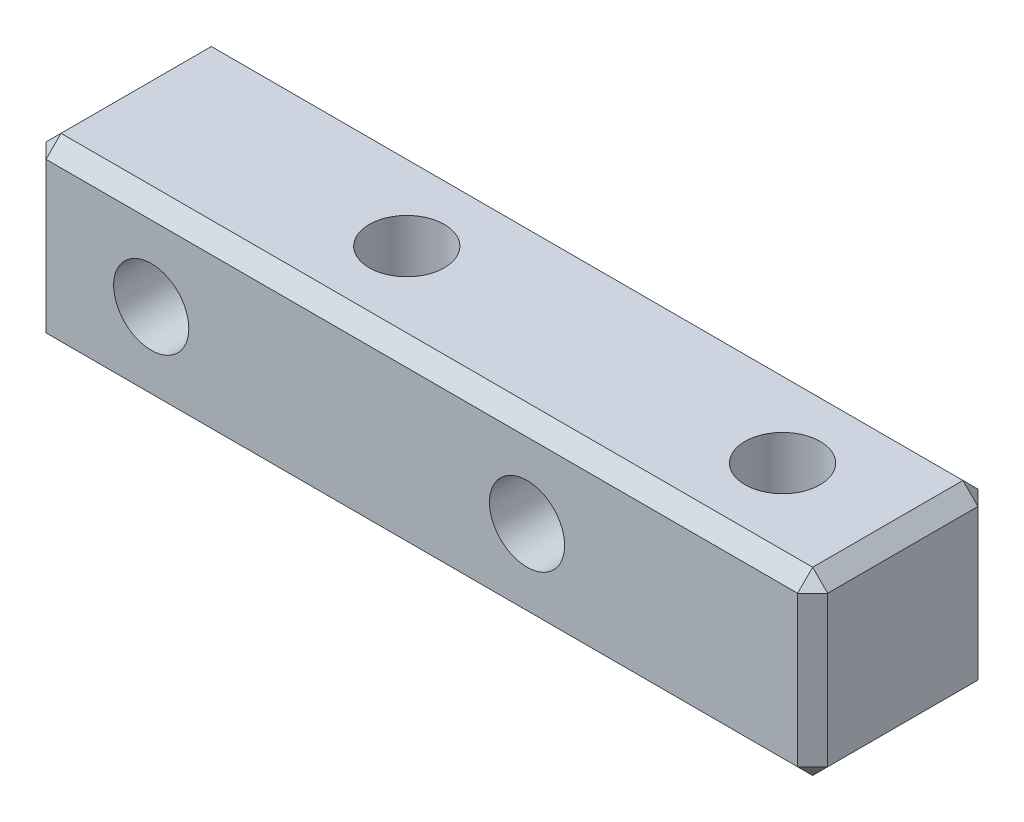
ISO-10303-21;
HEADER;
FILE_DESCRIPTION(('STEP AP214'),'2;1');
FILE_NAME('part.step','',(''),(''),'','','');
FILE_SCHEMA(('AUTOMOTIVE_DESIGN { 1 0 10303 214 1 1 1 1 }'));
ENDSEC;
DATA;
#1=APPLICATION_CONTEXT('core data for automotive mechanical design processes');
#2=APPLICATION_PROTOCOL_DEFINITION('international standard','automotive_design',2000,#1);
#3=PRODUCT_CONTEXT('',#1,'mechanical');
#4=PRODUCT('Part','Part','',(#3));
#5=PRODUCT_RELATED_PRODUCT_CATEGORY('part','',(#4));
#6=PRODUCT_DEFINITION_FORMATION('','',#4);
#7=PRODUCT_DEFINITION_CONTEXT('part definition',#1,'design');
#8=PRODUCT_DEFINITION('design','',#6,#7);
#9=PRODUCT_DEFINITION_SHAPE('','',#8);
#10=(LENGTH_UNIT() NAMED_UNIT(*) SI_UNIT(.MILLI.,.METRE.));
#11=(NAMED_UNIT(*) PLANE_ANGLE_UNIT() SI_UNIT($,.RADIAN.));
#12=(NAMED_UNIT(*) SI_UNIT($,.STERADIAN.) SOLID_ANGLE_UNIT());
#13=UNCERTAINTY_MEASURE_WITH_UNIT(LENGTH_MEASURE(1.E-05),#10,'distance_accuracy_value','');
#14=(GEOMETRIC_REPRESENTATION_CONTEXT(3) GLOBAL_UNCERTAINTY_ASSIGNED_CONTEXT((#13)) GLOBAL_UNIT_ASSIGNED_CONTEXT((#10,
#11,#12)) REPRESENTATION_CONTEXT('',''));
#15=CARTESIAN_POINT('',(0.,0.,0.));
#16=DIRECTION('',(0.,0.,1.));
#17=DIRECTION('',(1.,0.,0.));
#18=AXIS2_PLACEMENT_3D('',#15,#16,#17);
#19=CARTESIAN_POINT('',(13.,-3.,6.));
#20=DIRECTION('',(-1.,0.,0.));
#21=DIRECTION('',(0.,0.,1.));
#22=AXIS2_PLACEMENT_3D('',#19,#20,#21);
#23=PLANE('',#22);
#24=DIRECTION('',(0.,0.,-1.));
#25=VECTOR('',#24,1.);
#26=CARTESIAN_POINT('',(13.,-2.5,6.));
#27=LINE('',#26,#25);
#28=CARTESIAN_POINT('',(13.,-2.5,5.49999999999999));
#29=VERTEX_POINT('',#28);
#30=CARTESIAN_POINT('',(13.,-2.5,0.500000000000004));
#31=VERTEX_POINT('',#30);
#32=EDGE_CURVE('E173',#29,#31,#27,.T.);
#33=ORIENTED_EDGE('',*,*,#32,.T.);
#34=DIRECTION('',(0.,1.,0.));
#35=VECTOR('',#34,1.);
#36=CARTESIAN_POINT('',(13.,3.,0.500000000000004));
#37=LINE('',#36,#35);
#38=CARTESIAN_POINT('',(13.,2.49999999999999,0.500000000000004));
#39=VERTEX_POINT('',#38);
#40=EDGE_CURVE('E142',#31,#39,#37,.T.);
#41=ORIENTED_EDGE('',*,*,#40,.T.);
#42=DIRECTION('',(0.,0.,1.));
#43=VECTOR('',#42,1.);
#44=CARTESIAN_POINT('',(13.,2.49999999999999,6.));
#45=LINE('',#44,#43);
#46=CARTESIAN_POINT('',(13.,2.49999999999999,5.49999999999999));
#47=VERTEX_POINT('',#46);
#48=EDGE_CURVE('E163',#39,#47,#45,.T.);
#49=ORIENTED_EDGE('',*,*,#48,.T.);
#50=DIRECTION('',(0.,-1.,0.));
#51=VECTOR('',#50,1.);
#52=CARTESIAN_POINT('',(13.,-3.,5.49999999999999));
#53=LINE('',#52,#51);
#54=EDGE_CURVE('E170',#47,#29,#53,.T.);
#55=ORIENTED_EDGE('',*,*,#54,.T.);
#56=EDGE_LOOP('',(#33,#41,#49,#55));
#57=FACE_BOUND('',#56,.T.);
#58=ADVANCED_FACE('F46',(#57),#23,.F.);
#59=CARTESIAN_POINT('',(-13.,3.,6.));
#60=DIRECTION('',(0.,-1.,0.));
#61=DIRECTION('',(0.,0.,-1.));
#62=AXIS2_PLACEMENT_3D('',#59,#60,#61);
#63=PLANE('',#62);
#64=CARTESIAN_POINT('',(-3.5,3.,3.));
#65=DIRECTION('',(0.,1.,0.));
#66=DIRECTION('',(0.,0.,1.));
#67=AXIS2_PLACEMENT_3D('',#64,#65,#66);
#68=CIRCLE('',#67,1.24999999999999);
#69=CARTESIAN_POINT('',(-3.5,3.,4.24999999999999));
#70=VERTEX_POINT('',#69);
#71=EDGE_CURVE('E861',#70,#70,#68,.T.);
#72=ORIENTED_EDGE('',*,*,#71,.F.);
#73=EDGE_LOOP('',(#72));
#74=FACE_BOUND('',#73,.T.);
#75=CARTESIAN_POINT('',(9.,3.,3.));
#76=DIRECTION('',(0.,1.,0.));
#77=DIRECTION('',(0.,0.,1.));
#78=AXIS2_PLACEMENT_3D('',#75,#76,#77);
#79=CIRCLE('',#78,1.24999999999999);
#80=CARTESIAN_POINT('',(9.,3.,4.24999999999999));
#81=VERTEX_POINT('',#80);
#82=EDGE_CURVE('E808',#81,#81,#79,.T.);
#83=ORIENTED_EDGE('',*,*,#82,.F.);
#84=EDGE_LOOP('',(#83));
#85=FACE_BOUND('',#84,.T.);
#86=DIRECTION('',(1.,0.,0.));
#87=VECTOR('',#86,1.);
#88=CARTESIAN_POINT('',(-13.,3.,5.5));
#89=LINE('',#88,#87);
#90=CARTESIAN_POINT('',(-12.5,3.,5.5));
#91=VERTEX_POINT('',#90);
#92=CARTESIAN_POINT('',(12.5,3.,5.5));
#93=VERTEX_POINT('',#92);
#94=EDGE_CURVE('E57',#91,#93,#89,.T.);
#95=ORIENTED_EDGE('',*,*,#94,.T.);
#96=DIRECTION('',(0.,0.,-1.));
#97=VECTOR('',#96,1.);
#98=CARTESIAN_POINT('',(12.5,3.,6.));
#99=LINE('',#98,#97);
#100=CARTESIAN_POINT('',(12.5,3.,0.500000000000004));
#101=VERTEX_POINT('',#100);
#102=EDGE_CURVE('E11',#93,#101,#99,.T.);
#103=ORIENTED_EDGE('',*,*,#102,.T.);
#104=DIRECTION('',(-1.,0.,0.));
#105=VECTOR('',#104,1.);
#106=CARTESIAN_POINT('',(-13.,3.,0.500000000000004));
#107=LINE('',#106,#105);
#108=CARTESIAN_POINT('',(-12.5,3.,0.500000000000004));
#109=VERTEX_POINT('',#108);
#110=EDGE_CURVE('E233',#101,#109,#107,.T.);
#111=ORIENTED_EDGE('',*,*,#110,.T.);
#112=DIRECTION('',(0.,0.,1.));
#113=VECTOR('',#112,1.);
#114=CARTESIAN_POINT('',(-12.5,3.,6.));
#115=LINE('',#114,#113);
#116=EDGE_CURVE('E68',#109,#91,#115,.T.);
#117=ORIENTED_EDGE('',*,*,#116,.T.);
#118=EDGE_LOOP('',(#95,#103,#111,#117));
#119=FACE_BOUND('',#118,.T.);
#120=ADVANCED_FACE('F377',(#74,#85,#119),#63,.F.);
#121=CARTESIAN_POINT('',(-13.,-3.,6.));
#122=DIRECTION('',(1.,0.,0.));
#123=DIRECTION('',(0.,0.,-1.));
#124=AXIS2_PLACEMENT_3D('',#121,#122,#123);
#125=PLANE('',#124);
#126=DIRECTION('',(0.,-1.,0.));
#127=VECTOR('',#126,1.);
#128=CARTESIAN_POINT('',(-13.,-3.,0.500000000000004));
#129=LINE('',#128,#127);
#130=CARTESIAN_POINT('',(-13.,2.49999999999999,0.500000000000004));
#131=VERTEX_POINT('',#130);
#132=CARTESIAN_POINT('',(-13.,-2.49999999999999,0.500000000000004));
#133=VERTEX_POINT('',#132);
#134=EDGE_CURVE('E213',#131,#133,#129,.T.);
#135=ORIENTED_EDGE('',*,*,#134,.T.);
#136=DIRECTION('',(0.,0.,1.));
#137=VECTOR('',#136,1.);
#138=CARTESIAN_POINT('',(-13.,-2.49999999999999,6.));
#139=LINE('',#138,#137);
#140=CARTESIAN_POINT('',(-13.,-2.49999999999999,5.49999999999999));
#141=VERTEX_POINT('',#140);
#142=EDGE_CURVE('E216',#133,#141,#139,.T.);
#143=ORIENTED_EDGE('',*,*,#142,.T.);
#144=DIRECTION('',(0.,1.,0.));
#145=VECTOR('',#144,1.);
#146=CARTESIAN_POINT('',(-13.,-3.,5.49999999999999));
#147=LINE('',#146,#145);
#148=CARTESIAN_POINT('',(-13.,2.49999999999999,5.49999999999999));
#149=VERTEX_POINT('',#148);
#150=EDGE_CURVE('E210',#141,#149,#147,.T.);
#151=ORIENTED_EDGE('',*,*,#150,.T.);
#152=DIRECTION('',(0.,0.,-1.));
#153=VECTOR('',#152,1.);
#154=CARTESIAN_POINT('',(-13.,2.49999999999999,6.));
#155=LINE('',#154,#153);
#156=EDGE_CURVE('E207',#149,#131,#155,.T.);
#157=ORIENTED_EDGE('',*,*,#156,.T.);
#158=EDGE_LOOP('',(#135,#143,#151,#157));
#159=FACE_BOUND('',#158,.T.);
#160=ADVANCED_FACE('F333',(#159),#125,.F.);
#161=CARTESIAN_POINT('',(-13.,-3.,6.));
#162=DIRECTION('',(0.,1.,0.));
#163=DIRECTION('',(0.,0.,1.));
#164=AXIS2_PLACEMENT_3D('',#161,#162,#163);
#165=PLANE('',#164);
#166=CARTESIAN_POINT('',(-3.5,-3.,3.));
#167=DIRECTION('',(0.,1.,0.));
#168=DIRECTION('',(0.,0.,1.));
#169=AXIS2_PLACEMENT_3D('',#166,#167,#168);
#170=CIRCLE('',#169,1.25);
#171=CARTESIAN_POINT('',(-3.5,-3.,4.25));
#172=VERTEX_POINT('',#171);
#173=EDGE_CURVE('E802',#172,#172,#170,.T.);
#174=ORIENTED_EDGE('',*,*,#173,.T.);
#175=EDGE_LOOP('',(#174));
#176=FACE_BOUND('',#175,.T.);
#177=CARTESIAN_POINT('',(9.,-3.,3.));
#178=DIRECTION('',(0.,1.,0.));
#179=DIRECTION('',(0.,0.,1.));
#180=AXIS2_PLACEMENT_3D('',#177,#178,#179);
#181=CIRCLE('',#180,1.25);
#182=CARTESIAN_POINT('',(9.,-3.,4.25));
#183=VERTEX_POINT('',#182);
#184=EDGE_CURVE('E805',#183,#183,#181,.T.);
#185=ORIENTED_EDGE('',*,*,#184,.T.);
#186=EDGE_LOOP('',(#185));
#187=FACE_BOUND('',#186,.T.);
#188=DIRECTION('',(1.,0.,0.));
#189=VECTOR('',#188,1.);
#190=CARTESIAN_POINT('',(13.,-3.,0.500000000000004));
#191=LINE('',#190,#189);
#192=CARTESIAN_POINT('',(-12.5,-3.,0.500000000000004));
#193=VERTEX_POINT('',#192);
#194=CARTESIAN_POINT('',(12.5,-3.,0.500000000000004));
#195=VERTEX_POINT('',#194);
#196=EDGE_CURVE('E200',#193,#195,#191,.T.);
#197=ORIENTED_EDGE('',*,*,#196,.T.);
#198=DIRECTION('',(0.,0.,1.));
#199=VECTOR('',#198,1.);
#200=CARTESIAN_POINT('',(12.5,-3.,6.));
#201=LINE('',#200,#199);
#202=CARTESIAN_POINT('',(12.5,-3.,5.49999999999999));
#203=VERTEX_POINT('',#202);
#204=EDGE_CURVE('E203',#195,#203,#201,.T.);
#205=ORIENTED_EDGE('',*,*,#204,.T.);
#206=DIRECTION('',(-1.,0.,0.));
#207=VECTOR('',#206,1.);
#208=CARTESIAN_POINT('',(-13.,-3.,5.49999999999999));
#209=LINE('',#208,#207);
#210=CARTESIAN_POINT('',(-12.5,-3.,5.49999999999999));
#211=VERTEX_POINT('',#210);
#212=EDGE_CURVE('E194',#203,#211,#209,.T.);
#213=ORIENTED_EDGE('',*,*,#212,.T.);
#214=DIRECTION('',(0.,0.,-1.));
#215=VECTOR('',#214,1.);
#216=CARTESIAN_POINT('',(-12.5,-3.,6.));
#217=LINE('',#216,#215);
#218=EDGE_CURVE('E197',#211,#193,#217,.T.);
#219=ORIENTED_EDGE('',*,*,#218,.T.);
#220=EDGE_LOOP('',(#197,#205,#213,#219));
#221=FACE_BOUND('',#220,.T.);
#222=ADVANCED_FACE('F354',(#176,#187,#221),#165,.F.);
#223=CARTESIAN_POINT('',(0.,0.,6.));
#224=DIRECTION('',(0.,0.,-1.));
#225=DIRECTION('',(-1.,0.,0.));
#226=AXIS2_PLACEMENT_3D('',#223,#224,#225);
#227=PLANE('',#226);
#228=CARTESIAN_POINT('',(-9.,0.,6.));
#229=DIRECTION('',(0.,0.,1.));
#230=DIRECTION('',(1.,0.,0.));
#231=AXIS2_PLACEMENT_3D('',#228,#229,#230);
#232=CIRCLE('',#231,1.24999999999999);
#233=CARTESIAN_POINT('',(-7.75000000000001,0.,6.));
#234=VERTEX_POINT('',#233);
#235=EDGE_CURVE('E807',#234,#234,#232,.T.);
#236=ORIENTED_EDGE('',*,*,#235,.F.);
#237=EDGE_LOOP('',(#236));
#238=FACE_BOUND('',#237,.T.);
#239=CARTESIAN_POINT('',(3.5,0.,6.));
#240=DIRECTION('',(0.,0.,1.));
#241=DIRECTION('',(1.,0.,0.));
#242=AXIS2_PLACEMENT_3D('',#239,#240,#241);
#243=CIRCLE('',#242,1.24999999999999);
#244=CARTESIAN_POINT('',(4.74999999999999,0.,6.));
#245=VERTEX_POINT('',#244);
#246=EDGE_CURVE('E823',#245,#245,#243,.T.);
#247=ORIENTED_EDGE('',*,*,#246,.F.);
#248=EDGE_LOOP('',(#247));
#249=FACE_BOUND('',#248,.T.);
#250=DIRECTION('',(0.,-1.,0.));
#251=VECTOR('',#250,1.);
#252=CARTESIAN_POINT('',(-12.5,0.,6.));
#253=LINE('',#252,#251);
#254=CARTESIAN_POINT('',(-12.5,2.49999999999999,6.));
#255=VERTEX_POINT('',#254);
#256=CARTESIAN_POINT('',(-12.5,-2.5,6.));
#257=VERTEX_POINT('',#256);
#258=EDGE_CURVE('E226',#255,#257,#253,.T.);
#259=ORIENTED_EDGE('',*,*,#258,.T.);
#260=DIRECTION('',(1.,0.,0.));
#261=VECTOR('',#260,1.);
#262=CARTESIAN_POINT('',(0.,-2.5,6.));
#263=LINE('',#262,#261);
#264=CARTESIAN_POINT('',(12.5,-2.5,6.));
#265=VERTEX_POINT('',#264);
#266=EDGE_CURVE('E229',#257,#265,#263,.T.);
#267=ORIENTED_EDGE('',*,*,#266,.T.);
#268=DIRECTION('',(0.,1.,0.));
#269=VECTOR('',#268,1.);
#270=CARTESIAN_POINT('',(12.5,0.,6.));
#271=LINE('',#270,#269);
#272=CARTESIAN_POINT('',(12.5,2.49999999999999,6.));
#273=VERTEX_POINT('',#272);
#274=EDGE_CURVE('E223',#265,#273,#271,.T.);
#275=ORIENTED_EDGE('',*,*,#274,.T.);
#276=DIRECTION('',(-1.,0.,0.));
#277=VECTOR('',#276,1.);
#278=CARTESIAN_POINT('',(0.,2.49999999999999,6.));
#279=LINE('',#278,#277);
#280=EDGE_CURVE('E220',#273,#255,#279,.T.);
#281=ORIENTED_EDGE('',*,*,#280,.T.);
#282=EDGE_LOOP('',(#259,#267,#275,#281));
#283=FACE_BOUND('',#282,.T.);
#284=ADVANCED_FACE('F368',(#238,#249,#283),#227,.F.);
#285=CARTESIAN_POINT('',(0.,0.,0.));
#286=DIRECTION('',(0.,0.,-1.));
#287=DIRECTION('',(-1.,0.,0.));
#288=AXIS2_PLACEMENT_3D('',#285,#286,#287);
#289=PLANE('',#288);
#290=CARTESIAN_POINT('',(-9.,0.,0.));
#291=DIRECTION('',(0.,0.,1.));
#292=DIRECTION('',(1.,0.,0.));
#293=AXIS2_PLACEMENT_3D('',#290,#291,#292);
#294=CIRCLE('',#293,1.25);
#295=CARTESIAN_POINT('',(-7.75,0.,0.));
#296=VERTEX_POINT('',#295);
#297=EDGE_CURVE('E815',#296,#296,#294,.T.);
#298=ORIENTED_EDGE('',*,*,#297,.T.);
#299=EDGE_LOOP('',(#298));
#300=FACE_BOUND('',#299,.T.);
#301=CARTESIAN_POINT('',(3.5,0.,0.));
#302=DIRECTION('',(0.,0.,1.));
#303=DIRECTION('',(1.,0.,0.));
#304=AXIS2_PLACEMENT_3D('',#301,#302,#303);
#305=CIRCLE('',#304,1.25);
#306=CARTESIAN_POINT('',(4.75,0.,0.));
#307=VERTEX_POINT('',#306);
#308=EDGE_CURVE('E148',#307,#307,#305,.T.);
#309=ORIENTED_EDGE('',*,*,#308,.T.);
#310=EDGE_LOOP('',(#309));
#311=FACE_BOUND('',#310,.T.);
#312=DIRECTION('',(1.,0.,0.));
#313=VECTOR('',#312,1.);
#314=CARTESIAN_POINT('',(13.,2.49999999999999,0.));
#315=LINE('',#314,#313);
#316=CARTESIAN_POINT('',(-12.5,2.49999999999999,0.));
#317=VERTEX_POINT('',#316);
#318=CARTESIAN_POINT('',(12.5,2.49999999999999,0.));
#319=VERTEX_POINT('',#318);
#320=EDGE_CURVE('E176',#317,#319,#315,.T.);
#321=ORIENTED_EDGE('',*,*,#320,.T.);
#322=DIRECTION('',(0.,-1.,0.));
#323=VECTOR('',#322,1.);
#324=CARTESIAN_POINT('',(12.5,-3.,0.));
#325=LINE('',#324,#323);
#326=CARTESIAN_POINT('',(12.5,-2.49999999999999,0.));
#327=VERTEX_POINT('',#326);
#328=EDGE_CURVE('E144',#319,#327,#325,.T.);
#329=ORIENTED_EDGE('',*,*,#328,.T.);
#330=DIRECTION('',(-1.,0.,0.));
#331=VECTOR('',#330,1.);
#332=CARTESIAN_POINT('',(-13.,-2.49999999999999,0.));
#333=LINE('',#332,#331);
#334=CARTESIAN_POINT('',(-12.5,-2.49999999999999,0.));
#335=VERTEX_POINT('',#334);
#336=EDGE_CURVE('E189',#327,#335,#333,.T.);
#337=ORIENTED_EDGE('',*,*,#336,.T.);
#338=DIRECTION('',(0.,1.,0.));
#339=VECTOR('',#338,1.);
#340=CARTESIAN_POINT('',(-12.5,3.,0.));
#341=LINE('',#340,#339);
#342=EDGE_CURVE('E182',#335,#317,#341,.T.);
#343=ORIENTED_EDGE('',*,*,#342,.T.);
#344=EDGE_LOOP('',(#321,#329,#337,#343));
#345=FACE_BOUND('',#344,.T.);
#346=ADVANCED_FACE('F388',(#300,#311,#345),#289,.T.);
#347=CARTESIAN_POINT('',(-12.5,0.,6.));
#348=DIRECTION('',(0.70710678118655,0.,-0.707106781186545));
#349=DIRECTION('',(0.,-1.,0.));
#350=AXIS2_PLACEMENT_3D('',#347,#348,#349);
#351=PLANE('',#350);
#352=DIRECTION('',(0.707106781186545,0.,0.70710678118655));
#353=VECTOR('',#352,1.);
#354=CARTESIAN_POINT('',(-13.,-2.49999999999999,5.49999999999999));
#355=LINE('',#354,#353);
#356=EDGE_CURVE('E51',#257,#141,#355,.F.);
#357=ORIENTED_EDGE('',*,*,#356,.F.);
#358=ORIENTED_EDGE('',*,*,#258,.F.);
#359=DIRECTION('',(-0.707106781186545,0.,-0.70710678118655));
#360=VECTOR('',#359,1.);
#361=CARTESIAN_POINT('',(-13.,2.49999999999999,5.49999999999999));
#362=LINE('',#361,#360);
#363=EDGE_CURVE('E308',#149,#255,#362,.F.);
#364=ORIENTED_EDGE('',*,*,#363,.F.);
#365=ORIENTED_EDGE('',*,*,#150,.F.);
#366=EDGE_LOOP('',(#357,#358,#364,#365));
#367=FACE_BOUND('',#366,.T.);
#368=ADVANCED_FACE('F49',(#367),#351,.F.);
#369=CARTESIAN_POINT('',(-13.,-2.49999999999999,5.49999999999999));
#370=DIRECTION('',(-0.57735026918963,-0.577350269189626,0.577350269189622));
#371=DIRECTION('',(0.707106781186545,-0.70710678118655,0.));
#372=AXIS2_PLACEMENT_3D('',#369,#370,#371);
#373=PLANE('',#372);
#374=DIRECTION('',(0.,-0.707106781186545,-0.70710678118655));
#375=VECTOR('',#374,1.);
#376=CARTESIAN_POINT('',(-12.5,-2.75,5.75));
#377=LINE('',#376,#375);
#378=EDGE_CURVE('E302',#257,#211,#377,.T.);
#379=ORIENTED_EDGE('',*,*,#378,.F.);
#380=ORIENTED_EDGE('',*,*,#356,.T.);
#381=DIRECTION('',(-0.707106781186545,0.70710678118655,0.));
#382=VECTOR('',#381,1.);
#383=CARTESIAN_POINT('',(-13.,-2.49999999999999,5.49999999999999));
#384=LINE('',#383,#382);
#385=EDGE_CURVE('E306',#211,#141,#384,.T.);
#386=ORIENTED_EDGE('',*,*,#385,.F.);
#387=EDGE_LOOP('',(#379,#380,#386));
#388=FACE_BOUND('',#387,.T.);
#389=ADVANCED_FACE('F326',(#388),#373,.T.);
#390=CARTESIAN_POINT('',(-13.,2.49999999999999,5.49999999999999));
#391=DIRECTION('',(-0.57735026918963,0.577350269189622,0.577350269189626));
#392=DIRECTION('',(0.707106781186545,0.,0.70710678118655));
#393=AXIS2_PLACEMENT_3D('',#390,#391,#392);
#394=PLANE('',#393);
#395=DIRECTION('',(0.707106781186545,0.70710678118655,0.));
#396=VECTOR('',#395,1.);
#397=CARTESIAN_POINT('',(-13.,2.49999999999999,5.49999999999999));
#398=LINE('',#397,#396);
#399=EDGE_CURVE('E295',#149,#91,#398,.T.);
#400=ORIENTED_EDGE('',*,*,#399,.F.);
#401=ORIENTED_EDGE('',*,*,#363,.T.);
#402=DIRECTION('',(0.,-0.70710678118655,0.707106781186545));
#403=VECTOR('',#402,1.);
#404=CARTESIAN_POINT('',(-12.5,2.75,5.75));
#405=LINE('',#404,#403);
#406=EDGE_CURVE('E298',#91,#255,#405,.T.);
#407=ORIENTED_EDGE('',*,*,#406,.F.);
#408=EDGE_LOOP('',(#400,#401,#407));
#409=FACE_BOUND('',#408,.T.);
#410=ADVANCED_FACE('F499',(#409),#394,.T.);
#411=CARTESIAN_POINT('',(-12.5,-3.,6.));
#412=DIRECTION('',(0.70710678118655,0.707106781186545,0.));
#413=DIRECTION('',(0.,0.,-1.));
#414=AXIS2_PLACEMENT_3D('',#411,#412,#413);
#415=PLANE('',#414);
#416=ORIENTED_EDGE('',*,*,#385,.T.);
#417=ORIENTED_EDGE('',*,*,#142,.F.);
#418=DIRECTION('',(0.707106781186545,-0.70710678118655,0.));
#419=VECTOR('',#418,1.);
#420=CARTESIAN_POINT('',(-12.75,-2.75,0.500000000000004));
#421=LINE('',#420,#419);
#422=EDGE_CURVE('E287',#193,#133,#421,.F.);
#423=ORIENTED_EDGE('',*,*,#422,.F.);
#424=ORIENTED_EDGE('',*,*,#218,.F.);
#425=EDGE_LOOP('',(#416,#417,#423,#424));
#426=FACE_BOUND('',#425,.T.);
#427=ADVANCED_FACE('F338',(#426),#415,.F.);
#428=CARTESIAN_POINT('',(0.,-2.5,6.));
#429=DIRECTION('',(0.,0.70710678118655,-0.707106781186545));
#430=DIRECTION('',(1.,0.,0.));
#431=AXIS2_PLACEMENT_3D('',#428,#429,#430);
#432=PLANE('',#431);
#433=ORIENTED_EDGE('',*,*,#378,.T.);
#434=ORIENTED_EDGE('',*,*,#212,.F.);
#435=DIRECTION('',(0.,0.707106781186545,0.70710678118655));
#436=VECTOR('',#435,1.);
#437=CARTESIAN_POINT('',(12.5,-3.,5.49999999999999));
#438=LINE('',#437,#436);
#439=EDGE_CURVE('E283',#265,#203,#438,.F.);
#440=ORIENTED_EDGE('',*,*,#439,.F.);
#441=ORIENTED_EDGE('',*,*,#266,.F.);
#442=EDGE_LOOP('',(#433,#434,#440,#441));
#443=FACE_BOUND('',#442,.T.);
#444=ADVANCED_FACE('F366',(#443),#432,.F.);
#445=CARTESIAN_POINT('',(12.5,0.,6.));
#446=DIRECTION('',(-0.70710678118655,0.,-0.707106781186545));
#447=DIRECTION('',(0.,1.,0.));
#448=AXIS2_PLACEMENT_3D('',#445,#446,#447);
#449=PLANE('',#448);
#450=DIRECTION('',(-0.707106781186545,0.,0.70710678118655));
#451=VECTOR('',#450,1.);
#452=CARTESIAN_POINT('',(12.5,2.49999999999999,6.));
#453=LINE('',#452,#451);
#454=EDGE_CURVE('E276',#273,#47,#453,.F.);
#455=ORIENTED_EDGE('',*,*,#454,.F.);
#456=ORIENTED_EDGE('',*,*,#274,.F.);
#457=DIRECTION('',(0.707106781186545,0.,-0.70710678118655));
#458=VECTOR('',#457,1.);
#459=CARTESIAN_POINT('',(12.75,-2.5,5.75));
#460=LINE('',#459,#458);
#461=EDGE_CURVE('E280',#29,#265,#460,.F.);
#462=ORIENTED_EDGE('',*,*,#461,.F.);
#463=ORIENTED_EDGE('',*,*,#54,.F.);
#464=EDGE_LOOP('',(#455,#456,#462,#463));
#465=FACE_BOUND('',#464,.T.);
#466=ADVANCED_FACE('F374',(#465),#449,.F.);
#467=CARTESIAN_POINT('',(0.,2.49999999999999,6.));
#468=DIRECTION('',(0.,-0.707106781186545,-0.70710678118655));
#469=DIRECTION('',(-1.,0.,0.));
#470=AXIS2_PLACEMENT_3D('',#467,#468,#469);
#471=PLANE('',#470);
#472=ORIENTED_EDGE('',*,*,#406,.T.);
#473=ORIENTED_EDGE('',*,*,#280,.F.);
#474=DIRECTION('',(0.,0.70710678118655,-0.707106781186545));
#475=VECTOR('',#474,1.);
#476=CARTESIAN_POINT('',(12.5,2.49999999999999,6.));
#477=LINE('',#476,#475);
#478=EDGE_CURVE('E272',#93,#273,#477,.F.);
#479=ORIENTED_EDGE('',*,*,#478,.F.);
#480=ORIENTED_EDGE('',*,*,#94,.F.);
#481=EDGE_LOOP('',(#472,#473,#479,#480));
#482=FACE_BOUND('',#481,.T.);
#483=ADVANCED_FACE('F372',(#482),#471,.F.);
#484=CARTESIAN_POINT('',(-13.,2.49999999999999,6.));
#485=DIRECTION('',(0.70710678118655,-0.707106781186545,0.));
#486=DIRECTION('',(0.,0.,-1.));
#487=AXIS2_PLACEMENT_3D('',#484,#485,#486);
#488=PLANE('',#487);
#489=ORIENTED_EDGE('',*,*,#399,.T.);
#490=ORIENTED_EDGE('',*,*,#116,.F.);
#491=DIRECTION('',(-0.707106781186545,-0.70710678118655,0.));
#492=VECTOR('',#491,1.);
#493=CARTESIAN_POINT('',(-12.75,2.75,0.500000000000004));
#494=LINE('',#493,#492);
#495=EDGE_CURVE('E268',#131,#109,#494,.F.);
#496=ORIENTED_EDGE('',*,*,#495,.F.);
#497=ORIENTED_EDGE('',*,*,#156,.F.);
#498=EDGE_LOOP('',(#489,#490,#496,#497));
#499=FACE_BOUND('',#498,.T.);
#500=ADVANCED_FACE('F380',(#499),#488,.F.);
#501=CARTESIAN_POINT('',(-13.,-3.,0.500000000000004));
#502=DIRECTION('',(-0.707106781186545,0.,-0.70710678118655));
#503=DIRECTION('',(0.,1.,0.));
#504=AXIS2_PLACEMENT_3D('',#501,#502,#503);
#505=PLANE('',#504);
#506=DIRECTION('',(0.70710678118655,0.,-0.707106781186545));
#507=VECTOR('',#506,1.);
#508=CARTESIAN_POINT('',(-12.5,-2.49999999999999,0.));
#509=LINE('',#508,#507);
#510=EDGE_CURVE('E291',#133,#335,#509,.T.);
#511=ORIENTED_EDGE('',*,*,#510,.F.);
#512=ORIENTED_EDGE('',*,*,#134,.F.);
#513=DIRECTION('',(-0.70710678118655,0.,0.707106781186545));
#514=VECTOR('',#513,1.);
#515=CARTESIAN_POINT('',(-12.5,2.49999999999999,0.));
#516=LINE('',#515,#514);
#517=EDGE_CURVE('E264',#317,#131,#516,.T.);
#518=ORIENTED_EDGE('',*,*,#517,.F.);
#519=ORIENTED_EDGE('',*,*,#342,.F.);
#520=EDGE_LOOP('',(#511,#512,#518,#519));
#521=FACE_BOUND('',#520,.T.);
#522=ADVANCED_FACE('F342',(#521),#505,.T.);
#523=CARTESIAN_POINT('',(-12.5,-2.49999999999999,0.));
#524=DIRECTION('',(-0.577350269189626,-0.577350269189622,-0.57735026918963));
#525=DIRECTION('',(-0.70710678118655,0.,0.707106781186545));
#526=AXIS2_PLACEMENT_3D('',#523,#524,#525);
#527=PLANE('',#526);
#528=ORIENTED_EDGE('',*,*,#422,.T.);
#529=ORIENTED_EDGE('',*,*,#510,.T.);
#530=DIRECTION('',(0.,-0.70710678118655,0.707106781186545));
#531=VECTOR('',#530,1.);
#532=CARTESIAN_POINT('',(-12.5,-2.49999999999999,0.));
#533=LINE('',#532,#531);
#534=EDGE_CURVE('E260',#193,#335,#533,.F.);
#535=ORIENTED_EDGE('',*,*,#534,.F.);
#536=EDGE_LOOP('',(#528,#529,#535));
#537=FACE_BOUND('',#536,.T.);
#538=ADVANCED_FACE('F346',(#537),#527,.T.);
#539=CARTESIAN_POINT('',(12.5,-3.,5.49999999999999));
#540=DIRECTION('',(0.577350269189626,-0.57735026918963,0.577350269189622));
#541=DIRECTION('',(0.70710678118655,0.707106781186545,0.));
#542=AXIS2_PLACEMENT_3D('',#539,#540,#541);
#543=PLANE('',#542);
#544=ORIENTED_EDGE('',*,*,#461,.T.);
#545=ORIENTED_EDGE('',*,*,#439,.T.);
#546=DIRECTION('',(-0.70710678118655,-0.707106781186545,0.));
#547=VECTOR('',#546,1.);
#548=CARTESIAN_POINT('',(12.5,-3.,5.49999999999999));
#549=LINE('',#548,#547);
#550=EDGE_CURVE('E257',#29,#203,#549,.T.);
#551=ORIENTED_EDGE('',*,*,#550,.F.);
#552=EDGE_LOOP('',(#544,#545,#551));
#553=FACE_BOUND('',#552,.T.);
#554=ADVANCED_FACE('F362',(#553),#543,.T.);
#555=CARTESIAN_POINT('',(12.5,2.49999999999999,6.));
#556=DIRECTION('',(0.57735026918963,0.577350269189622,0.577350269189626));
#557=DIRECTION('',(0.707106781186545,0.,-0.70710678118655));
#558=AXIS2_PLACEMENT_3D('',#555,#556,#557);
#559=PLANE('',#558);
#560=ORIENTED_EDGE('',*,*,#478,.T.);
#561=ORIENTED_EDGE('',*,*,#454,.T.);
#562=DIRECTION('',(0.707106781186545,-0.70710678118655,0.));
#563=VECTOR('',#562,1.);
#564=CARTESIAN_POINT('',(12.75,2.75,5.49999999999999));
#565=LINE('',#564,#563);
#566=EDGE_CURVE('E166',#93,#47,#565,.T.);
#567=ORIENTED_EDGE('',*,*,#566,.F.);
#568=EDGE_LOOP('',(#560,#561,#567));
#569=FACE_BOUND('',#568,.T.);
#570=ADVANCED_FACE('F376',(#569),#559,.T.);
#571=CARTESIAN_POINT('',(-12.5,2.49999999999999,0.));
#572=DIRECTION('',(-0.577350269189626,0.577350269189622,-0.57735026918963));
#573=DIRECTION('',(-0.70710678118655,0.,0.707106781186545));
#574=AXIS2_PLACEMENT_3D('',#571,#572,#573);
#575=PLANE('',#574);
#576=ORIENTED_EDGE('',*,*,#517,.T.);
#577=ORIENTED_EDGE('',*,*,#495,.T.);
#578=DIRECTION('',(0.,-0.70710678118655,-0.707106781186545));
#579=VECTOR('',#578,1.);
#580=CARTESIAN_POINT('',(-12.5,2.49999999999999,0.));
#581=LINE('',#580,#579);
#582=EDGE_CURVE('E251',#317,#109,#581,.F.);
#583=ORIENTED_EDGE('',*,*,#582,.F.);
#584=EDGE_LOOP('',(#576,#577,#583));
#585=FACE_BOUND('',#584,.T.);
#586=ADVANCED_FACE('F384',(#585),#575,.T.);
#587=CARTESIAN_POINT('',(-13.,-3.,0.500000000000004));
#588=DIRECTION('',(0.,-0.707106781186545,-0.70710678118655));
#589=DIRECTION('',(-1.,0.,0.));
#590=AXIS2_PLACEMENT_3D('',#587,#588,#589);
#591=PLANE('',#590);
#592=ORIENTED_EDGE('',*,*,#534,.T.);
#593=ORIENTED_EDGE('',*,*,#336,.F.);
#594=DIRECTION('',(0.,0.70710678118655,-0.707106781186545));
#595=VECTOR('',#594,1.);
#596=CARTESIAN_POINT('',(12.5,-2.49999999999999,0.));
#597=LINE('',#596,#595);
#598=EDGE_CURVE('E247',#195,#327,#597,.T.);
#599=ORIENTED_EDGE('',*,*,#598,.F.);
#600=ORIENTED_EDGE('',*,*,#196,.F.);
#601=EDGE_LOOP('',(#592,#593,#599,#600));
#602=FACE_BOUND('',#601,.T.);
#603=ADVANCED_FACE('F351',(#602),#591,.T.);
#604=CARTESIAN_POINT('',(13.,-2.5,6.));
#605=DIRECTION('',(-0.707106781186545,0.70710678118655,0.));
#606=DIRECTION('',(0.,0.,-1.));
#607=AXIS2_PLACEMENT_3D('',#604,#605,#606);
#608=PLANE('',#607);
#609=ORIENTED_EDGE('',*,*,#550,.T.);
#610=ORIENTED_EDGE('',*,*,#204,.F.);
#611=DIRECTION('',(0.70710678118655,0.707106781186545,0.));
#612=VECTOR('',#611,1.);
#613=CARTESIAN_POINT('',(12.75,-2.75,0.500000000000004));
#614=LINE('',#613,#612);
#615=EDGE_CURVE('E160',#31,#195,#614,.F.);
#616=ORIENTED_EDGE('',*,*,#615,.F.);
#617=ORIENTED_EDGE('',*,*,#32,.F.);
#618=EDGE_LOOP('',(#609,#610,#616,#617));
#619=FACE_BOUND('',#618,.T.);
#620=ADVANCED_FACE('F356',(#619),#608,.F.);
#621=CARTESIAN_POINT('',(12.5,3.,6.));
#622=DIRECTION('',(-0.70710678118655,-0.707106781186545,0.));
#623=DIRECTION('',(0.,0.,-1.));
#624=AXIS2_PLACEMENT_3D('',#621,#622,#623);
#625=PLANE('',#624);
#626=ORIENTED_EDGE('',*,*,#566,.T.);
#627=ORIENTED_EDGE('',*,*,#48,.F.);
#628=DIRECTION('',(-0.707106781186545,0.70710678118655,0.));
#629=VECTOR('',#628,1.);
#630=CARTESIAN_POINT('',(13.,2.49999999999999,0.500000000000004));
#631=LINE('',#630,#629);
#632=EDGE_CURVE('E151',#101,#39,#631,.F.);
#633=ORIENTED_EDGE('',*,*,#632,.F.);
#634=ORIENTED_EDGE('',*,*,#102,.F.);
#635=EDGE_LOOP('',(#626,#627,#633,#634));
#636=FACE_BOUND('',#635,.T.);
#637=ADVANCED_FACE('F164',(#636),#625,.F.);
#638=CARTESIAN_POINT('',(-13.,3.,0.500000000000004));
#639=DIRECTION('',(0.,0.707106781186545,-0.70710678118655));
#640=DIRECTION('',(1.,0.,0.));
#641=AXIS2_PLACEMENT_3D('',#638,#639,#640);
#642=PLANE('',#641);
#643=ORIENTED_EDGE('',*,*,#582,.T.);
#644=ORIENTED_EDGE('',*,*,#110,.F.);
#645=DIRECTION('',(0.,0.70710678118655,0.707106781186545));
#646=VECTOR('',#645,1.);
#647=CARTESIAN_POINT('',(12.5,2.75,0.250000000000002));
#648=LINE('',#647,#646);
#649=EDGE_CURVE('E155',#319,#101,#648,.T.);
#650=ORIENTED_EDGE('',*,*,#649,.F.);
#651=ORIENTED_EDGE('',*,*,#320,.F.);
#652=EDGE_LOOP('',(#643,#644,#650,#651));
#653=FACE_BOUND('',#652,.T.);
#654=ADVANCED_FACE('F386',(#653),#642,.T.);
#655=CARTESIAN_POINT('',(12.5,-2.49999999999999,0.));
#656=DIRECTION('',(0.577350269189622,-0.577350269189626,-0.57735026918963));
#657=DIRECTION('',(0.,0.70710678118655,-0.707106781186545));
#658=AXIS2_PLACEMENT_3D('',#655,#656,#657);
#659=PLANE('',#658);
#660=ORIENTED_EDGE('',*,*,#615,.T.);
#661=ORIENTED_EDGE('',*,*,#598,.T.);
#662=DIRECTION('',(0.70710678118655,0.,0.707106781186545));
#663=VECTOR('',#662,1.);
#664=CARTESIAN_POINT('',(12.5,-2.49999999999999,0.));
#665=LINE('',#664,#663);
#666=EDGE_CURVE('E147',#31,#327,#665,.F.);
#667=ORIENTED_EDGE('',*,*,#666,.F.);
#668=EDGE_LOOP('',(#660,#661,#667));
#669=FACE_BOUND('',#668,.T.);
#670=ADVANCED_FACE('F422',(#669),#659,.T.);
#671=CARTESIAN_POINT('',(13.,2.49999999999999,0.500000000000004));
#672=DIRECTION('',(0.577350269189626,0.577350269189622,-0.57735026918963));
#673=DIRECTION('',(-0.70710678118655,0.,-0.707106781186545));
#674=AXIS2_PLACEMENT_3D('',#671,#672,#673);
#675=PLANE('',#674);
#676=ORIENTED_EDGE('',*,*,#649,.T.);
#677=ORIENTED_EDGE('',*,*,#632,.T.);
#678=DIRECTION('',(-0.70710678118655,0.,-0.707106781186545));
#679=VECTOR('',#678,1.);
#680=CARTESIAN_POINT('',(13.,2.49999999999999,0.500000000000004));
#681=LINE('',#680,#679);
#682=EDGE_CURVE('E138',#319,#39,#681,.F.);
#683=ORIENTED_EDGE('',*,*,#682,.F.);
#684=EDGE_LOOP('',(#676,#677,#683));
#685=FACE_BOUND('',#684,.T.);
#686=ADVANCED_FACE('F153',(#685),#675,.T.);
#687=CARTESIAN_POINT('',(13.,-3.,0.500000000000004));
#688=DIRECTION('',(0.707106781186545,0.,-0.70710678118655));
#689=DIRECTION('',(0.,-1.,0.));
#690=AXIS2_PLACEMENT_3D('',#687,#688,#689);
#691=PLANE('',#690);
#692=ORIENTED_EDGE('',*,*,#666,.T.);
#693=ORIENTED_EDGE('',*,*,#328,.F.);
#694=ORIENTED_EDGE('',*,*,#682,.T.);
#695=ORIENTED_EDGE('',*,*,#40,.F.);
#696=EDGE_LOOP('',(#692,#693,#694,#695));
#697=FACE_BOUND('',#696,.T.);
#698=ADVANCED_FACE('F140',(#697),#691,.T.);
#699=CARTESIAN_POINT('',(3.5,0.,6.));
#700=DIRECTION('',(0.,0.,1.));
#701=DIRECTION('',(1.,0.,0.));
#702=AXIS2_PLACEMENT_3D('',#699,#700,#701);
#703=CYLINDRICAL_SURFACE('',#702,1.24999999999999);
#704=ORIENTED_EDGE('',*,*,#308,.F.);
#705=EDGE_LOOP('',(#704));
#706=FACE_BOUND('',#705,.T.);
#707=ORIENTED_EDGE('',*,*,#246,.T.);
#708=EDGE_LOOP('',(#707));
#709=FACE_BOUND('',#708,.T.);
#710=ADVANCED_FACE('F416',(#706,#709),#703,.F.);
#711=CARTESIAN_POINT('',(-9.,0.,6.));
#712=DIRECTION('',(0.,0.,1.));
#713=DIRECTION('',(1.,0.,0.));
#714=AXIS2_PLACEMENT_3D('',#711,#712,#713);
#715=CYLINDRICAL_SURFACE('',#714,1.24999999999999);
#716=ORIENTED_EDGE('',*,*,#297,.F.);
#717=EDGE_LOOP('',(#716));
#718=FACE_BOUND('',#717,.T.);
#719=ORIENTED_EDGE('',*,*,#235,.T.);
#720=EDGE_LOOP('',(#719));
#721=FACE_BOUND('',#720,.T.);
#722=ADVANCED_FACE('F589',(#718,#721),#715,.F.);
#723=CARTESIAN_POINT('',(9.,3.,3.));
#724=DIRECTION('',(0.,1.,0.));
#725=DIRECTION('',(0.,0.,1.));
#726=AXIS2_PLACEMENT_3D('',#723,#724,#725);
#727=CYLINDRICAL_SURFACE('',#726,1.24999999999999);
#728=ORIENTED_EDGE('',*,*,#184,.F.);
#729=EDGE_LOOP('',(#728));
#730=FACE_BOUND('',#729,.T.);
#731=ORIENTED_EDGE('',*,*,#82,.T.);
#732=EDGE_LOOP('',(#731));
#733=FACE_BOUND('',#732,.T.);
#734=ADVANCED_FACE('F597',(#730,#733),#727,.F.);
#735=CARTESIAN_POINT('',(-3.5,3.,3.));
#736=DIRECTION('',(0.,1.,0.));
#737=DIRECTION('',(0.,0.,1.));
#738=AXIS2_PLACEMENT_3D('',#735,#736,#737);
#739=CYLINDRICAL_SURFACE('',#738,1.24999999999999);
#740=ORIENTED_EDGE('',*,*,#173,.F.);
#741=EDGE_LOOP('',(#740));
#742=FACE_BOUND('',#741,.T.);
#743=ORIENTED_EDGE('',*,*,#71,.T.);
#744=EDGE_LOOP('',(#743));
#745=FACE_BOUND('',#744,.T.);
#746=ADVANCED_FACE('F605',(#742,#745),#739,.F.);
#747=CLOSED_SHELL('',(#58,#120,#160,#222,#284,#346,#368,#389,#410,#427,#444,#466,#483,#500,#522,
#538,#554,#570,#586,#603,#620,#637,#654,#670,#686,#698,#710,#722,#734,#746));
#748=MANIFOLD_SOLID_BREP('B2',#747);
#749=ADVANCED_BREP_SHAPE_REPRESENTATION('',(#18,#748),#14);
#750=SHAPE_DEFINITION_REPRESENTATION(#9,#749);
ENDSEC;
END-ISO-10303-21;
